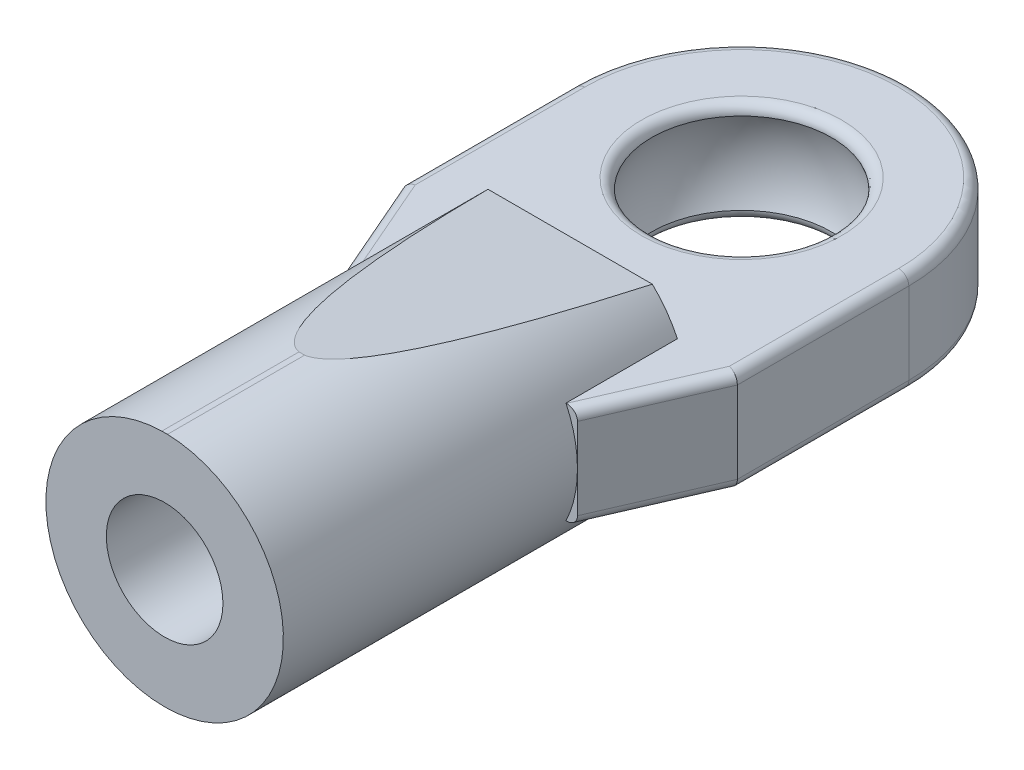
ISO-10303-21;
HEADER;
FILE_DESCRIPTION(('STEP AP214'),'2;1');
FILE_NAME('part.step','',(''),(''),'','','');
FILE_SCHEMA(('AUTOMOTIVE_DESIGN { 1 0 10303 214 1 1 1 1 }'));
ENDSEC;
DATA;
#1=APPLICATION_CONTEXT('core data for automotive mechanical design processes');
#2=APPLICATION_PROTOCOL_DEFINITION('international standard','automotive_design',2000,#1);
#3=PRODUCT_CONTEXT('',#1,'mechanical');
#4=PRODUCT('Part','Part','',(#3));
#5=PRODUCT_RELATED_PRODUCT_CATEGORY('part','',(#4));
#6=PRODUCT_DEFINITION_FORMATION('','',#4);
#7=PRODUCT_DEFINITION_CONTEXT('part definition',#1,'design');
#8=PRODUCT_DEFINITION('design','',#6,#7);
#9=PRODUCT_DEFINITION_SHAPE('','',#8);
#10=(LENGTH_UNIT() NAMED_UNIT(*) SI_UNIT(.MILLI.,.METRE.));
#11=(NAMED_UNIT(*) PLANE_ANGLE_UNIT() SI_UNIT($,.RADIAN.));
#12=(NAMED_UNIT(*) SI_UNIT($,.STERADIAN.) SOLID_ANGLE_UNIT());
#13=UNCERTAINTY_MEASURE_WITH_UNIT(LENGTH_MEASURE(1.E-05),#10,'distance_accuracy_value','');
#14=(GEOMETRIC_REPRESENTATION_CONTEXT(3) GLOBAL_UNCERTAINTY_ASSIGNED_CONTEXT((#13)) GLOBAL_UNIT_ASSIGNED_CONTEXT((#10,
#11,#12)) REPRESENTATION_CONTEXT('',''));
#15=CARTESIAN_POINT('',(0.,0.,0.));
#16=DIRECTION('',(0.,0.,1.));
#17=DIRECTION('',(1.,0.,0.));
#18=AXIS2_PLACEMENT_3D('',#15,#16,#17);
#19=CARTESIAN_POINT('',(0.,0.,5.6642));
#20=DIRECTION('',(0.,0.,-1.));
#21=DIRECTION('',(-1.,0.,0.));
#22=AXIS2_PLACEMENT_3D('',#19,#20,#21);
#23=PLANE('',#22);
#24=DIRECTION('',(1.,0.,0.));
#25=VECTOR('',#24,1.);
#26=CARTESIAN_POINT('',(0.,-1.51,5.6642));
#27=LINE('',#26,#25);
#28=CARTESIAN_POINT('',(-0.838522414727217,-1.51,5.6642));
#29=VERTEX_POINT('',#28);
#30=CARTESIAN_POINT('',(0.838522414727215,-1.51,5.6642));
#31=VERTEX_POINT('',#30);
#32=EDGE_CURVE('E243',#29,#31,#27,.T.);
#33=ORIENTED_EDGE('',*,*,#32,.F.);
#34=CARTESIAN_POINT('',(0.,0.,5.6642));
#35=DIRECTION('',(0.,0.,1.));
#36=DIRECTION('',(1.,0.,0.));
#37=AXIS2_PLACEMENT_3D('',#34,#35,#36);
#38=CIRCLE('',#37,1.72719999999999);
#39=EDGE_CURVE('E263',#29,#31,#38,.T.);
#40=ORIENTED_EDGE('',*,*,#39,.T.);
#41=EDGE_LOOP('',(#33,#40));
#42=FACE_BOUND('',#41,.T.);
#43=ADVANCED_FACE('F55',(#42),#23,.F.);
#44=CARTESIAN_POINT('',(0.,0.,0.));
#45=DIRECTION('',(0.,0.,-1.));
#46=DIRECTION('',(-1.,0.,0.));
#47=AXIS2_PLACEMENT_3D('',#44,#45,#46);
#48=CYLINDRICAL_SURFACE('',#47,3.5179);
#49=CARTESIAN_POINT('',(0.,0.,-15.5618463564135));
#50=DIRECTION('',(0.,-0.992519880266169,0.122083116262772));
#51=DIRECTION('',(0.,-0.122083116262772,-0.992519880266169));
#52=AXIS2_PLACEMENT_3D('',#49,#50,#51);
#53=ELLIPSE('',#52,28.8156143756034,3.5179);
#54=CARTESIAN_POINT('',(2.43496060353404,2.53901305022979,5.08));
#55=VERTEX_POINT('',#54);
#56=CARTESIAN_POINT('',(0.0833247089606735,3.51691305022979,13.0302));
#57=VERTEX_POINT('',#56);
#58=EDGE_CURVE('E385',#55,#57,#53,.T.);
#59=ORIENTED_EDGE('',*,*,#58,.T.);
#60=DIRECTION('',(0.,0.,-1.));
#61=VECTOR('',#60,1.);
#62=CARTESIAN_POINT('',(0.0833247089606735,3.51691305022979,17.0942));
#63=LINE('',#62,#61);
#64=CARTESIAN_POINT('',(0.0833247089606735,3.51691305022979,17.0942));
#65=VERTEX_POINT('',#64);
#66=EDGE_CURVE('E275',#65,#57,#63,.T.);
#67=ORIENTED_EDGE('',*,*,#66,.F.);
#68=CARTESIAN_POINT('',(0.,0.,17.0942));
#69=DIRECTION('',(0.,0.,1.));
#70=DIRECTION('',(-1.,0.,0.));
#71=AXIS2_PLACEMENT_3D('',#68,#69,#70);
#72=CIRCLE('',#71,3.5179);
#73=CARTESIAN_POINT('',(-0.0833247089607028,3.51691305022979,17.0942));
#74=VERTEX_POINT('',#73);
#75=EDGE_CURVE('E267',#74,#65,#72,.T.);
#76=ORIENTED_EDGE('',*,*,#75,.F.);
#77=DIRECTION('',(0.,0.,-1.));
#78=VECTOR('',#77,1.);
#79=CARTESIAN_POINT('',(-0.0833247089607028,3.51691305022979,17.0942));
#80=LINE('',#79,#78);
#81=CARTESIAN_POINT('',(-0.0833247089607028,3.51691305022979,13.0302));
#82=VERTEX_POINT('',#81);
#83=EDGE_CURVE('E272',#74,#82,#80,.T.);
#84=ORIENTED_EDGE('',*,*,#83,.T.);
#85=CARTESIAN_POINT('',(0.,0.,-15.5618463564135));
#86=DIRECTION('',(0.,-0.992519880266169,0.122083116262772));
#87=DIRECTION('',(0.,-0.122083116262772,-0.992519880266169));
#88=AXIS2_PLACEMENT_3D('',#85,#86,#87);
#89=ELLIPSE('',#88,28.8156143756034,3.5179);
#90=CARTESIAN_POINT('',(-2.43496060353404,2.53901305022979,5.08));
#91=VERTEX_POINT('',#90);
#92=EDGE_CURVE('E639',#82,#91,#89,.T.);
#93=ORIENTED_EDGE('',*,*,#92,.T.);
#94=CARTESIAN_POINT('',(0.,0.,5.08));
#95=DIRECTION('',(0.,0.,-1.));
#96=DIRECTION('',(-1.,0.,0.));
#97=AXIS2_PLACEMENT_3D('',#94,#95,#96);
#98=CIRCLE('',#97,3.5179);
#99=CARTESIAN_POINT('',(-3.17734486796759,1.51,5.08));
#100=VERTEX_POINT('',#99);
#101=EDGE_CURVE('E278',#91,#100,#98,.F.);
#102=ORIENTED_EDGE('',*,*,#101,.T.);
#103=DIRECTION('',(0.,0.,-1.));
#104=VECTOR('',#103,1.);
#105=CARTESIAN_POINT('',(-3.17734486796759,1.51,0.));
#106=LINE('',#105,#104);
#107=CARTESIAN_POINT('',(-3.17734486796759,1.51,8.382));
#108=VERTEX_POINT('',#107);
#109=EDGE_CURVE('E366',#100,#108,#106,.F.);
#110=ORIENTED_EDGE('',*,*,#109,.T.);
#111=CARTESIAN_POINT('',(0.,0.,8.382));
#112=DIRECTION('',(0.,0.,-1.));
#113=DIRECTION('',(-1.,0.,0.));
#114=AXIS2_PLACEMENT_3D('',#111,#112,#113);
#115=CIRCLE('',#114,3.5179);
#116=CARTESIAN_POINT('',(-3.51789999999999,0.,8.382));
#117=VERTEX_POINT('',#116);
#118=EDGE_CURVE('E477',#108,#117,#115,.F.);
#119=ORIENTED_EDGE('',*,*,#118,.T.);
#120=CARTESIAN_POINT('',(0.,0.,8.382));
#121=DIRECTION('',(0.,0.,-1.));
#122=DIRECTION('',(-1.,0.,0.));
#123=AXIS2_PLACEMENT_3D('',#120,#121,#122);
#124=CIRCLE('',#123,3.5179);
#125=CARTESIAN_POINT('',(-3.17734486796759,-1.51,8.382));
#126=VERTEX_POINT('',#125);
#127=EDGE_CURVE('E283',#117,#126,#124,.F.);
#128=ORIENTED_EDGE('',*,*,#127,.T.);
#129=DIRECTION('',(0.,0.,-1.));
#130=VECTOR('',#129,1.);
#131=CARTESIAN_POINT('',(-3.17734486796759,-1.51,0.));
#132=LINE('',#131,#130);
#133=CARTESIAN_POINT('',(-3.17734486796759,-1.51,5.08));
#134=VERTEX_POINT('',#133);
#135=EDGE_CURVE('E450',#126,#134,#132,.T.);
#136=ORIENTED_EDGE('',*,*,#135,.T.);
#137=CARTESIAN_POINT('',(0.,0.,5.07999999999999));
#138=DIRECTION('',(0.,0.,-1.));
#139=DIRECTION('',(0.,1.,0.));
#140=AXIS2_PLACEMENT_3D('',#137,#138,#139);
#141=CIRCLE('',#140,3.5179);
#142=CARTESIAN_POINT('',(-2.43290068253873,-2.54098694977022,5.08));
#143=VERTEX_POINT('',#142);
#144=EDGE_CURVE('E482',#134,#143,#141,.F.);
#145=ORIENTED_EDGE('',*,*,#144,.T.);
#146=CARTESIAN_POINT('',(0.,0.,-15.577893903327));
#147=DIRECTION('',(0.,0.992519880266169,0.12208311626277));
#148=DIRECTION('',(0.,0.12208311626277,-0.992519880266169));
#149=AXIS2_PLACEMENT_3D('',#146,#147,#148);
#150=ELLIPSE('',#149,28.8156143756039,3.5179);
#151=CARTESIAN_POINT('',(2.43290068253873,-2.54098694977022,5.08));
#152=VERTEX_POINT('',#151);
#153=EDGE_CURVE('E454',#143,#152,#150,.T.);
#154=ORIENTED_EDGE('',*,*,#153,.T.);
#155=CARTESIAN_POINT('',(0.,0.,5.07999999999999));
#156=DIRECTION('',(0.,0.,-1.));
#157=DIRECTION('',(0.,1.,0.));
#158=AXIS2_PLACEMENT_3D('',#155,#156,#157);
#159=CIRCLE('',#158,3.5179);
#160=CARTESIAN_POINT('',(3.17734486796759,-1.51,5.08));
#161=VERTEX_POINT('',#160);
#162=EDGE_CURVE('E480',#152,#161,#159,.F.);
#163=ORIENTED_EDGE('',*,*,#162,.T.);
#164=DIRECTION('',(0.,0.,-1.));
#165=VECTOR('',#164,1.);
#166=CARTESIAN_POINT('',(3.17734486796759,-1.51,0.));
#167=LINE('',#166,#165);
#168=CARTESIAN_POINT('',(3.17734486796759,-1.51,8.382));
#169=VERTEX_POINT('',#168);
#170=EDGE_CURVE('E285',#161,#169,#167,.F.);
#171=ORIENTED_EDGE('',*,*,#170,.T.);
#172=CARTESIAN_POINT('',(0.,0.,8.382));
#173=DIRECTION('',(0.,0.,-1.));
#174=DIRECTION('',(-1.,0.,0.));
#175=AXIS2_PLACEMENT_3D('',#172,#173,#174);
#176=CIRCLE('',#175,3.5179);
#177=CARTESIAN_POINT('',(3.5179,0.,8.382));
#178=VERTEX_POINT('',#177);
#179=EDGE_CURVE('E244',#169,#178,#176,.F.);
#180=ORIENTED_EDGE('',*,*,#179,.T.);
#181=CARTESIAN_POINT('',(0.,0.,8.38200000000001));
#182=DIRECTION('',(0.,0.,-1.));
#183=DIRECTION('',(-1.,0.,0.));
#184=AXIS2_PLACEMENT_3D('',#181,#182,#183);
#185=CIRCLE('',#184,3.5179);
#186=CARTESIAN_POINT('',(3.17734486796759,1.51,8.382));
#187=VERTEX_POINT('',#186);
#188=EDGE_CURVE('E386',#178,#187,#185,.F.);
#189=ORIENTED_EDGE('',*,*,#188,.T.);
#190=DIRECTION('',(0.,0.,-1.));
#191=VECTOR('',#190,1.);
#192=CARTESIAN_POINT('',(3.17734486796759,1.51,0.));
#193=LINE('',#192,#191);
#194=CARTESIAN_POINT('',(3.17734486796759,1.51,5.08));
#195=VERTEX_POINT('',#194);
#196=EDGE_CURVE('E380',#187,#195,#193,.T.);
#197=ORIENTED_EDGE('',*,*,#196,.T.);
#198=CARTESIAN_POINT('',(0.,0.,5.08));
#199=DIRECTION('',(0.,0.,-1.));
#200=DIRECTION('',(-1.,0.,0.));
#201=AXIS2_PLACEMENT_3D('',#198,#199,#200);
#202=CIRCLE('',#201,3.5179);
#203=EDGE_CURVE('E630',#195,#55,#202,.F.);
#204=ORIENTED_EDGE('',*,*,#203,.T.);
#205=EDGE_LOOP('',(#59,#67,#76,#84,#93,#102,#110,#119,#128,#136,#145,#154,#163,#171,#180,#189,
#197,#204));
#206=FACE_BOUND('',#205,.T.);
#207=ADVANCED_FACE('F619',(#206),#48,.T.);
#208=CARTESIAN_POINT('',(0.,0.,5.08));
#209=DIRECTION('',(0.,0.,1.));
#210=DIRECTION('',(1.,0.,0.));
#211=AXIS2_PLACEMENT_3D('',#208,#209,#210);
#212=PLANE('',#211);
#213=DIRECTION('',(1.,0.,0.));
#214=VECTOR('',#213,1.);
#215=CARTESIAN_POINT('',(0.,1.51,5.08));
#216=LINE('',#215,#214);
#217=EDGE_CURVE('E359',#100,#195,#216,.T.);
#218=ORIENTED_EDGE('',*,*,#217,.F.);
#219=ORIENTED_EDGE('',*,*,#101,.F.);
#220=DIRECTION('',(1.,0.,0.));
#221=VECTOR('',#220,1.);
#222=CARTESIAN_POINT('',(-6.17972211068289,2.53901305022979,5.08));
#223=LINE('',#222,#221);
#224=EDGE_CURVE('E368',#91,#55,#223,.T.);
#225=ORIENTED_EDGE('',*,*,#224,.T.);
#226=ORIENTED_EDGE('',*,*,#203,.F.);
#227=EDGE_LOOP('',(#218,#219,#225,#226));
#228=FACE_BOUND('',#227,.T.);
#229=ADVANCED_FACE('F640',(#228),#212,.F.);
#230=CARTESIAN_POINT('',(3.5179,1.51,8.382));
#231=DIRECTION('',(-0.917126126803996,0.,-0.398597124341735));
#232=DIRECTION('',(-0.398597124341735,0.,0.917126126803996));
#233=AXIS2_PLACEMENT_3D('',#230,#231,#232);
#234=PLANE('',#233);
#235=DIRECTION('',(0.,1.,0.));
#236=VECTOR('',#235,1.);
#237=CARTESIAN_POINT('',(3.5179,1.51,8.382));
#238=LINE('',#237,#236);
#239=CARTESIAN_POINT('',(3.5179,-1.21,8.382));
#240=VERTEX_POINT('',#239);
#241=EDGE_CURVE('E324',#240,#178,#238,.T.);
#242=ORIENTED_EDGE('',*,*,#241,.F.);
#243=DIRECTION('',(0.398597124341735,0.,-0.917126126803996));
#244=VECTOR('',#243,1.);
#245=CARTESIAN_POINT('',(3.5179,-1.21,8.382));
#246=LINE('',#245,#244);
#247=CARTESIAN_POINT('',(4.953,-1.21,5.08));
#248=VERTEX_POINT('',#247);
#249=EDGE_CURVE('E533',#240,#248,#246,.T.);
#250=ORIENTED_EDGE('',*,*,#249,.T.);
#251=DIRECTION('',(0.,1.,0.));
#252=VECTOR('',#251,1.);
#253=CARTESIAN_POINT('',(4.953,1.51,5.08));
#254=LINE('',#253,#252);
#255=CARTESIAN_POINT('',(4.953,1.21,5.08));
#256=VERTEX_POINT('',#255);
#257=EDGE_CURVE('E317',#248,#256,#254,.T.);
#258=ORIENTED_EDGE('',*,*,#257,.T.);
#259=DIRECTION('',(0.398597124341735,0.,-0.917126126803996));
#260=VECTOR('',#259,1.);
#261=CARTESIAN_POINT('',(3.5179,1.21,8.382));
#262=LINE('',#261,#260);
#263=CARTESIAN_POINT('',(3.5179,1.21,8.382));
#264=VERTEX_POINT('',#263);
#265=EDGE_CURVE('E531',#256,#264,#262,.F.);
#266=ORIENTED_EDGE('',*,*,#265,.T.);
#267=DIRECTION('',(0.,1.,0.));
#268=VECTOR('',#267,1.);
#269=CARTESIAN_POINT('',(3.5179,1.51,8.382));
#270=LINE('',#269,#268);
#271=EDGE_CURVE('E344',#264,#178,#270,.F.);
#272=ORIENTED_EDGE('',*,*,#271,.T.);
#273=EDGE_LOOP('',(#242,#250,#258,#266,#272));
#274=FACE_BOUND('',#273,.T.);
#275=ADVANCED_FACE('F582',(#274),#234,.F.);
#276=CARTESIAN_POINT('',(4.95299999999997,1.51,0.));
#277=DIRECTION('',(-1.,0.,0.));
#278=DIRECTION('',(0.,0.,1.));
#279=AXIS2_PLACEMENT_3D('',#276,#277,#278);
#280=PLANE('',#279);
#281=ORIENTED_EDGE('',*,*,#257,.F.);
#282=DIRECTION('',(0.,0.,-1.));
#283=VECTOR('',#282,1.);
#284=CARTESIAN_POINT('',(4.95299999999997,-1.21,0.));
#285=LINE('',#284,#283);
#286=CARTESIAN_POINT('',(4.95299999999998,-1.21,0.));
#287=VERTEX_POINT('',#286);
#288=EDGE_CURVE('E518',#248,#287,#285,.T.);
#289=ORIENTED_EDGE('',*,*,#288,.T.);
#290=DIRECTION('',(0.,-1.,0.));
#291=VECTOR('',#290,1.);
#292=CARTESIAN_POINT('',(4.95299999999998,1.51,0.));
#293=LINE('',#292,#291);
#294=CARTESIAN_POINT('',(4.95299999999998,1.21,0.));
#295=VERTEX_POINT('',#294);
#296=EDGE_CURVE('E323',#295,#287,#293,.T.);
#297=ORIENTED_EDGE('',*,*,#296,.F.);
#298=DIRECTION('',(0.,0.,-1.));
#299=VECTOR('',#298,1.);
#300=CARTESIAN_POINT('',(4.953,1.21,5.08));
#301=LINE('',#300,#299);
#302=EDGE_CURVE('E512',#295,#256,#301,.F.);
#303=ORIENTED_EDGE('',*,*,#302,.T.);
#304=EDGE_LOOP('',(#281,#289,#297,#303));
#305=FACE_BOUND('',#304,.T.);
#306=ADVANCED_FACE('F833',(#305),#280,.F.);
#307=CARTESIAN_POINT('',(0.,1.51,0.));
#308=DIRECTION('',(0.,-1.,0.));
#309=DIRECTION('',(0.,0.,-1.));
#310=AXIS2_PLACEMENT_3D('',#307,#308,#309);
#311=CYLINDRICAL_SURFACE('',#310,4.95299999999998);
#312=ORIENTED_EDGE('',*,*,#296,.T.);
#313=CARTESIAN_POINT('',(0.,-1.21,0.));
#314=DIRECTION('',(0.,1.,0.));
#315=DIRECTION('',(0.,0.,1.));
#316=AXIS2_PLACEMENT_3D('',#313,#314,#315);
#317=CIRCLE('',#316,4.95299999999998);
#318=CARTESIAN_POINT('',(-4.95299999999999,-1.21,0.));
#319=VERTEX_POINT('',#318);
#320=EDGE_CURVE('E529',#287,#319,#317,.T.);
#321=ORIENTED_EDGE('',*,*,#320,.T.);
#322=DIRECTION('',(0.,1.,0.));
#323=VECTOR('',#322,1.);
#324=CARTESIAN_POINT('',(-4.95299999999999,1.51,0.));
#325=LINE('',#324,#323);
#326=CARTESIAN_POINT('',(-4.95299999999999,1.21,0.));
#327=VERTEX_POINT('',#326);
#328=EDGE_CURVE('E516',#319,#327,#325,.T.);
#329=ORIENTED_EDGE('',*,*,#328,.T.);
#330=CARTESIAN_POINT('',(0.,1.21,0.));
#331=DIRECTION('',(0.,1.,0.));
#332=DIRECTION('',(0.,0.,1.));
#333=AXIS2_PLACEMENT_3D('',#330,#331,#332);
#334=CIRCLE('',#333,4.95299999999998);
#335=EDGE_CURVE('E527',#327,#295,#334,.F.);
#336=ORIENTED_EDGE('',*,*,#335,.T.);
#337=EDGE_LOOP('',(#312,#321,#329,#336));
#338=FACE_BOUND('',#337,.T.);
#339=ADVANCED_FACE('F845',(#338),#311,.T.);
#340=CARTESIAN_POINT('',(-4.95299999999999,1.51,0.));
#341=DIRECTION('',(1.,0.,0.));
#342=DIRECTION('',(0.,0.,-1.));
#343=AXIS2_PLACEMENT_3D('',#340,#341,#342);
#344=PLANE('',#343);
#345=ORIENTED_EDGE('',*,*,#328,.F.);
#346=DIRECTION('',(0.,0.,-1.));
#347=VECTOR('',#346,1.);
#348=CARTESIAN_POINT('',(-4.95299999999999,-1.21,0.));
#349=LINE('',#348,#347);
#350=CARTESIAN_POINT('',(-4.95299999999999,-1.21,5.08));
#351=VERTEX_POINT('',#350);
#352=EDGE_CURVE('E525',#319,#351,#349,.F.);
#353=ORIENTED_EDGE('',*,*,#352,.T.);
#354=DIRECTION('',(0.,1.,0.));
#355=VECTOR('',#354,1.);
#356=CARTESIAN_POINT('',(-4.95299999999999,1.51,5.08));
#357=LINE('',#356,#355);
#358=CARTESIAN_POINT('',(-4.95299999999999,1.21,5.08));
#359=VERTEX_POINT('',#358);
#360=EDGE_CURVE('E339',#351,#359,#357,.T.);
#361=ORIENTED_EDGE('',*,*,#360,.T.);
#362=DIRECTION('',(0.,0.,-1.));
#363=VECTOR('',#362,1.);
#364=CARTESIAN_POINT('',(-4.95299999999999,1.21,0.));
#365=LINE('',#364,#363);
#366=EDGE_CURVE('E520',#359,#327,#365,.T.);
#367=ORIENTED_EDGE('',*,*,#366,.T.);
#368=EDGE_LOOP('',(#345,#353,#361,#367));
#369=FACE_BOUND('',#368,.T.);
#370=ADVANCED_FACE('F858',(#369),#344,.F.);
#371=CARTESIAN_POINT('',(-3.51789999999999,1.51,8.382));
#372=DIRECTION('',(0.917126126803995,0.,-0.398597124341737));
#373=DIRECTION('',(-0.398597124341737,0.,-0.917126126803995));
#374=AXIS2_PLACEMENT_3D('',#371,#372,#373);
#375=PLANE('',#374);
#376=ORIENTED_EDGE('',*,*,#360,.F.);
#377=DIRECTION('',(-0.398597124341737,0.,-0.917126126803995));
#378=VECTOR('',#377,1.);
#379=CARTESIAN_POINT('',(-3.51789999999999,-1.21,8.382));
#380=LINE('',#379,#378);
#381=CARTESIAN_POINT('',(-3.51789999999999,-1.21,8.382));
#382=VERTEX_POINT('',#381);
#383=EDGE_CURVE('E508',#351,#382,#380,.F.);
#384=ORIENTED_EDGE('',*,*,#383,.T.);
#385=DIRECTION('',(0.,1.,0.));
#386=VECTOR('',#385,1.);
#387=CARTESIAN_POINT('',(-3.51789999999999,1.51,8.382));
#388=LINE('',#387,#386);
#389=EDGE_CURVE('E345',#117,#382,#388,.F.);
#390=ORIENTED_EDGE('',*,*,#389,.F.);
#391=DIRECTION('',(0.,1.,0.));
#392=VECTOR('',#391,1.);
#393=CARTESIAN_POINT('',(-3.51789999999999,1.51,8.382));
#394=LINE('',#393,#392);
#395=CARTESIAN_POINT('',(-3.51789999999999,1.21,8.382));
#396=VERTEX_POINT('',#395);
#397=EDGE_CURVE('E364',#117,#396,#394,.T.);
#398=ORIENTED_EDGE('',*,*,#397,.T.);
#399=DIRECTION('',(-0.398597124341737,0.,-0.917126126803995));
#400=VECTOR('',#399,1.);
#401=CARTESIAN_POINT('',(-4.95299999999999,1.21,5.08));
#402=LINE('',#401,#400);
#403=EDGE_CURVE('E505',#396,#359,#402,.T.);
#404=ORIENTED_EDGE('',*,*,#403,.T.);
#405=EDGE_LOOP('',(#376,#384,#390,#398,#404));
#406=FACE_BOUND('',#405,.T.);
#407=ADVANCED_FACE('F871',(#406),#375,.F.);
#408=CARTESIAN_POINT('',(-3.51789999999999,1.51,8.382));
#409=DIRECTION('',(0.,0.,-1.));
#410=DIRECTION('',(-1.,0.,0.));
#411=AXIS2_PLACEMENT_3D('',#408,#409,#410);
#412=PLANE('',#411);
#413=ORIENTED_EDGE('',*,*,#271,.F.);
#414=CARTESIAN_POINT('',(3.19079122920809,1.21,8.382));
#415=DIRECTION('',(0.,0.,-1.));
#416=DIRECTION('',(-1.,0.,0.));
#417=AXIS2_PLACEMENT_3D('',#414,#415,#416);
#418=ELLIPSE('',#417,0.32710877079191,0.3);
#419=CARTESIAN_POINT('',(3.19079122920809,1.51,8.382));
#420=VERTEX_POINT('',#419);
#421=EDGE_CURVE('E13',#264,#420,#418,.F.);
#422=ORIENTED_EDGE('',*,*,#421,.T.);
#423=DIRECTION('',(1.,0.,0.));
#424=VECTOR('',#423,1.);
#425=CARTESIAN_POINT('',(0.,1.51,8.382));
#426=LINE('',#425,#424);
#427=EDGE_CURVE('E365',#187,#420,#426,.T.);
#428=ORIENTED_EDGE('',*,*,#427,.F.);
#429=ORIENTED_EDGE('',*,*,#188,.F.);
#430=EDGE_LOOP('',(#413,#422,#428,#429));
#431=FACE_BOUND('',#430,.T.);
#432=ADVANCED_FACE('F586',(#431),#412,.F.);
#433=CARTESIAN_POINT('',(-6.17972211068289,3.51691305022979,13.0302));
#434=DIRECTION('',(0.,-0.992519880266169,0.122083116262772));
#435=DIRECTION('',(0.,-0.122083116262772,-0.992519880266169));
#436=AXIS2_PLACEMENT_3D('',#433,#434,#435);
#437=PLANE('',#436);
#438=ORIENTED_EDGE('',*,*,#92,.F.);
#439=DIRECTION('',(1.,0.,0.));
#440=VECTOR('',#439,1.);
#441=CARTESIAN_POINT('',(-6.17972211068289,3.51691305022979,13.0302));
#442=LINE('',#441,#440);
#443=EDGE_CURVE('E591',#57,#82,#442,.F.);
#444=ORIENTED_EDGE('',*,*,#443,.F.);
#445=ORIENTED_EDGE('',*,*,#58,.F.);
#446=ORIENTED_EDGE('',*,*,#224,.F.);
#447=EDGE_LOOP('',(#438,#444,#445,#446));
#448=FACE_BOUND('',#447,.T.);
#449=ADVANCED_FACE('F895',(#448),#437,.F.);
#450=CARTESIAN_POINT('',(0.,1.51,0.));
#451=DIRECTION('',(0.,1.,0.));
#452=DIRECTION('',(0.,0.,1.));
#453=AXIS2_PLACEMENT_3D('',#450,#451,#452);
#454=PLANE('',#453);
#455=CARTESIAN_POINT('',(0.,1.51,0.));
#456=DIRECTION('',(0.,1.,0.));
#457=DIRECTION('',(0.,0.,1.));
#458=AXIS2_PLACEMENT_3D('',#455,#456,#457);
#459=CIRCLE('',#458,2.967);
#460=CARTESIAN_POINT('',(0.,1.51,2.967));
#461=VERTEX_POINT('',#460);
#462=EDGE_CURVE('E537',#461,#461,#459,.F.);
#463=ORIENTED_EDGE('',*,*,#462,.T.);
#464=EDGE_LOOP('',(#463));
#465=FACE_BOUND('',#464,.T.);
#466=DIRECTION('',(0.,0.,-1.));
#467=VECTOR('',#466,1.);
#468=CARTESIAN_POINT('',(-4.65299999999999,1.51,5.08));
#469=LINE('',#468,#467);
#470=CARTESIAN_POINT('',(-4.65299999999998,1.51,0.));
#471=VERTEX_POINT('',#470);
#472=CARTESIAN_POINT('',(-4.65299999999999,1.51,5.01762583711596));
#473=VERTEX_POINT('',#472);
#474=EDGE_CURVE('E72',#471,#473,#469,.F.);
#475=ORIENTED_EDGE('',*,*,#474,.T.);
#476=DIRECTION('',(-0.398597124341737,0.,-0.917126126803995));
#477=VECTOR('',#476,1.);
#478=CARTESIAN_POINT('',(-3.24276216195879,1.51,8.26242086269748));
#479=LINE('',#478,#477);
#480=CARTESIAN_POINT('',(-3.19079122920808,1.51,8.382));
#481=VERTEX_POINT('',#480);
#482=EDGE_CURVE('E547',#473,#481,#479,.F.);
#483=ORIENTED_EDGE('',*,*,#482,.T.);
#484=DIRECTION('',(-1.,0.,0.));
#485=VECTOR('',#484,1.);
#486=CARTESIAN_POINT('',(-3.51789999999999,1.51,8.382));
#487=LINE('',#486,#485);
#488=EDGE_CURVE('E425',#481,#108,#487,.F.);
#489=ORIENTED_EDGE('',*,*,#488,.T.);
#490=ORIENTED_EDGE('',*,*,#109,.F.);
#491=ORIENTED_EDGE('',*,*,#217,.T.);
#492=ORIENTED_EDGE('',*,*,#196,.F.);
#493=ORIENTED_EDGE('',*,*,#427,.T.);
#494=DIRECTION('',(0.398597124341735,0.,-0.917126126803996));
#495=VECTOR('',#494,1.);
#496=CARTESIAN_POINT('',(4.6778621619588,1.51,4.96042086269748));
#497=LINE('',#496,#495);
#498=CARTESIAN_POINT('',(4.653,1.51,5.01762583711596));
#499=VERTEX_POINT('',#498);
#500=EDGE_CURVE('E541',#420,#499,#497,.T.);
#501=ORIENTED_EDGE('',*,*,#500,.T.);
#502=DIRECTION('',(0.,0.,-1.));
#503=VECTOR('',#502,1.);
#504=CARTESIAN_POINT('',(4.65299999999997,1.51,0.));
#505=LINE('',#504,#503);
#506=CARTESIAN_POINT('',(4.65299999999997,1.51,0.));
#507=VERTEX_POINT('',#506);
#508=EDGE_CURVE('E543',#499,#507,#505,.T.);
#509=ORIENTED_EDGE('',*,*,#508,.T.);
#510=CARTESIAN_POINT('',(0.,1.51,0.));
#511=DIRECTION('',(0.,1.,0.));
#512=DIRECTION('',(0.,0.,1.));
#513=AXIS2_PLACEMENT_3D('',#510,#511,#512);
#514=CIRCLE('',#513,4.65299999999998);
#515=EDGE_CURVE('E77',#507,#471,#514,.T.);
#516=ORIENTED_EDGE('',*,*,#515,.T.);
#517=EDGE_LOOP('',(#475,#483,#489,#490,#491,#492,#493,#501,#509,#516));
#518=FACE_BOUND('',#517,.T.);
#519=ADVANCED_FACE('F614',(#465,#518),#454,.T.);
#520=CARTESIAN_POINT('',(-3.51789999999999,1.51,8.382));
#521=DIRECTION('',(0.,0.,-1.));
#522=DIRECTION('',(-1.,0.,0.));
#523=AXIS2_PLACEMENT_3D('',#520,#521,#522);
#524=PLANE('',#523);
#525=ORIENTED_EDGE('',*,*,#488,.F.);
#526=CARTESIAN_POINT('',(-3.19079122920808,1.21,8.382));
#527=DIRECTION('',(0.,0.,-1.));
#528=DIRECTION('',(1.,0.,0.));
#529=AXIS2_PLACEMENT_3D('',#526,#527,#528);
#530=ELLIPSE('',#529,0.32710877079191,0.3);
#531=EDGE_CURVE('E64',#481,#396,#530,.F.);
#532=ORIENTED_EDGE('',*,*,#531,.T.);
#533=ORIENTED_EDGE('',*,*,#397,.F.);
#534=ORIENTED_EDGE('',*,*,#118,.F.);
#535=EDGE_LOOP('',(#525,#532,#533,#534));
#536=FACE_BOUND('',#535,.T.);
#537=ADVANCED_FACE('F919',(#536),#524,.F.);
#538=CARTESIAN_POINT('',(-6.17972211068289,-2.54098694977022,5.08));
#539=DIRECTION('',(0.,0.,-1.));
#540=DIRECTION('',(0.,1.,0.));
#541=AXIS2_PLACEMENT_3D('',#538,#539,#540);
#542=PLANE('',#541);
#543=ORIENTED_EDGE('',*,*,#162,.F.);
#544=DIRECTION('',(1.,0.,0.));
#545=VECTOR('',#544,1.);
#546=CARTESIAN_POINT('',(-6.17972211068289,-2.54098694977022,5.08));
#547=LINE('',#546,#545);
#548=EDGE_CURVE('E455',#152,#143,#547,.F.);
#549=ORIENTED_EDGE('',*,*,#548,.T.);
#550=ORIENTED_EDGE('',*,*,#144,.F.);
#551=DIRECTION('',(-1.,0.,0.));
#552=VECTOR('',#551,1.);
#553=CARTESIAN_POINT('',(0.,-1.51,5.08));
#554=LINE('',#553,#552);
#555=EDGE_CURVE('E459',#134,#161,#554,.F.);
#556=ORIENTED_EDGE('',*,*,#555,.T.);
#557=EDGE_LOOP('',(#543,#549,#550,#556));
#558=FACE_BOUND('',#557,.T.);
#559=ADVANCED_FACE('F932',(#558),#542,.T.);
#560=CARTESIAN_POINT('',(-3.51789999999999,1.51,8.382));
#561=DIRECTION('',(0.,0.,-1.));
#562=DIRECTION('',(-1.,0.,0.));
#563=AXIS2_PLACEMENT_3D('',#560,#561,#562);
#564=PLANE('',#563);
#565=ORIENTED_EDGE('',*,*,#389,.T.);
#566=CARTESIAN_POINT('',(-3.19079122920808,-1.21,8.382));
#567=DIRECTION('',(0.,0.,-1.));
#568=DIRECTION('',(-1.,0.,0.));
#569=AXIS2_PLACEMENT_3D('',#566,#567,#568);
#570=ELLIPSE('',#569,0.32710877079191,0.3);
#571=CARTESIAN_POINT('',(-3.19079122920808,-1.51,8.382));
#572=VERTEX_POINT('',#571);
#573=EDGE_CURVE('E510',#382,#572,#570,.F.);
#574=ORIENTED_EDGE('',*,*,#573,.T.);
#575=DIRECTION('',(1.,0.,0.));
#576=VECTOR('',#575,1.);
#577=CARTESIAN_POINT('',(0.,-1.51,8.382));
#578=LINE('',#577,#576);
#579=EDGE_CURVE('E284',#572,#126,#578,.T.);
#580=ORIENTED_EDGE('',*,*,#579,.T.);
#581=ORIENTED_EDGE('',*,*,#127,.F.);
#582=EDGE_LOOP('',(#565,#574,#580,#581));
#583=FACE_BOUND('',#582,.T.);
#584=ADVANCED_FACE('F675',(#583),#564,.F.);
#585=CARTESIAN_POINT('',(-6.17972211068289,-2.54098694977022,5.07999999999999));
#586=DIRECTION('',(0.,0.992519880266169,0.12208311626277));
#587=DIRECTION('',(0.,-0.12208311626277,0.992519880266169));
#588=AXIS2_PLACEMENT_3D('',#585,#586,#587);
#589=PLANE('',#588);
#590=ORIENTED_EDGE('',*,*,#153,.F.);
#591=ORIENTED_EDGE('',*,*,#548,.F.);
#592=EDGE_LOOP('',(#590,#591));
#593=FACE_BOUND('',#592,.T.);
#594=ADVANCED_FACE('F957',(#593),#589,.F.);
#595=CARTESIAN_POINT('',(0.,-1.51,0.));
#596=DIRECTION('',(0.,1.,0.));
#597=DIRECTION('',(0.,0.,1.));
#598=AXIS2_PLACEMENT_3D('',#595,#596,#597);
#599=PLANE('',#598);
#600=CARTESIAN_POINT('',(0.,-1.51,0.));
#601=DIRECTION('',(0.,1.,0.));
#602=DIRECTION('',(0.,0.,1.));
#603=AXIS2_PLACEMENT_3D('',#600,#601,#602);
#604=CIRCLE('',#603,2.967);
#605=CARTESIAN_POINT('',(0.,-1.51,2.967));
#606=VERTEX_POINT('',#605);
#607=EDGE_CURVE('E491',#606,#606,#604,.T.);
#608=ORIENTED_EDGE('',*,*,#607,.T.);
#609=EDGE_LOOP('',(#608));
#610=FACE_BOUND('',#609,.T.);
#611=ORIENTED_EDGE('',*,*,#579,.F.);
#612=DIRECTION('',(-0.398597124341737,0.,-0.917126126803995));
#613=VECTOR('',#612,1.);
#614=CARTESIAN_POINT('',(-5.74799545962332,-1.51,2.49816725745168));
#615=LINE('',#614,#613);
#616=CARTESIAN_POINT('',(-4.65299999999999,-1.51,5.01762583711596));
#617=VERTEX_POINT('',#616);
#618=EDGE_CURVE('E502',#572,#617,#615,.T.);
#619=ORIENTED_EDGE('',*,*,#618,.T.);
#620=DIRECTION('',(0.,0.,-1.));
#621=VECTOR('',#620,1.);
#622=CARTESIAN_POINT('',(-4.65299999999999,-1.51,0.));
#623=LINE('',#622,#621);
#624=CARTESIAN_POINT('',(-4.65299999999998,-1.51,0.));
#625=VERTEX_POINT('',#624);
#626=EDGE_CURVE('E500',#617,#625,#623,.T.);
#627=ORIENTED_EDGE('',*,*,#626,.T.);
#628=CARTESIAN_POINT('',(0.,-1.51,0.));
#629=DIRECTION('',(0.,1.,0.));
#630=DIRECTION('',(0.,0.,1.));
#631=AXIS2_PLACEMENT_3D('',#628,#629,#630);
#632=CIRCLE('',#631,4.65299999999998);
#633=CARTESIAN_POINT('',(4.65299999999997,-1.51,0.));
#634=VERTEX_POINT('',#633);
#635=EDGE_CURVE('E498',#625,#634,#632,.F.);
#636=ORIENTED_EDGE('',*,*,#635,.T.);
#637=DIRECTION('',(0.,0.,-1.));
#638=VECTOR('',#637,1.);
#639=CARTESIAN_POINT('',(4.65299999999997,-1.51,0.));
#640=LINE('',#639,#638);
#641=CARTESIAN_POINT('',(4.653,-1.51,5.01762583711596));
#642=VERTEX_POINT('',#641);
#643=EDGE_CURVE('E496',#634,#642,#640,.F.);
#644=ORIENTED_EDGE('',*,*,#643,.T.);
#645=DIRECTION('',(0.398597124341735,0.,-0.917126126803996));
#646=VECTOR('',#645,1.);
#647=CARTESIAN_POINT('',(5.74799545962332,-1.51,2.49816725745166));
#648=LINE('',#647,#646);
#649=CARTESIAN_POINT('',(3.1907912292081,-1.51,8.382));
#650=VERTEX_POINT('',#649);
#651=EDGE_CURVE('E494',#642,#650,#648,.F.);
#652=ORIENTED_EDGE('',*,*,#651,.T.);
#653=DIRECTION('',(-1.,0.,0.));
#654=VECTOR('',#653,1.);
#655=CARTESIAN_POINT('',(-3.51789999999999,-1.51,8.382));
#656=LINE('',#655,#654);
#657=EDGE_CURVE('E279',#650,#169,#656,.T.);
#658=ORIENTED_EDGE('',*,*,#657,.T.);
#659=ORIENTED_EDGE('',*,*,#170,.F.);
#660=ORIENTED_EDGE('',*,*,#555,.F.);
#661=ORIENTED_EDGE('',*,*,#135,.F.);
#662=EDGE_LOOP('',(#611,#619,#627,#636,#644,#652,#658,#659,#660,#661));
#663=FACE_BOUND('',#662,.T.);
#664=ADVANCED_FACE('F686',(#610,#663),#599,.F.);
#665=CARTESIAN_POINT('',(-3.51789999999999,1.51,8.382));
#666=DIRECTION('',(0.,0.,-1.));
#667=DIRECTION('',(-1.,0.,0.));
#668=AXIS2_PLACEMENT_3D('',#665,#666,#667);
#669=PLANE('',#668);
#670=ORIENTED_EDGE('',*,*,#657,.F.);
#671=CARTESIAN_POINT('',(3.1907912292081,-1.21,8.382));
#672=DIRECTION('',(0.,0.,-1.));
#673=DIRECTION('',(1.,0.,0.));
#674=AXIS2_PLACEMENT_3D('',#671,#672,#673);
#675=ELLIPSE('',#674,0.32710877079191,0.3);
#676=EDGE_CURVE('E535',#650,#240,#675,.F.);
#677=ORIENTED_EDGE('',*,*,#676,.T.);
#678=ORIENTED_EDGE('',*,*,#241,.T.);
#679=ORIENTED_EDGE('',*,*,#179,.F.);
#680=EDGE_LOOP('',(#670,#677,#678,#679));
#681=FACE_BOUND('',#680,.T.);
#682=ADVANCED_FACE('F701',(#681),#669,.F.);
#683=CARTESIAN_POINT('',(-0.0833247089607028,3.51691305022979,17.0942));
#684=DIRECTION('',(0.,-1.,0.));
#685=DIRECTION('',(0.,0.,-1.));
#686=AXIS2_PLACEMENT_3D('',#683,#684,#685);
#687=PLANE('',#686);
#688=ORIENTED_EDGE('',*,*,#443,.T.);
#689=ORIENTED_EDGE('',*,*,#83,.F.);
#690=DIRECTION('',(-1.,0.,0.));
#691=VECTOR('',#690,1.);
#692=CARTESIAN_POINT('',(-0.0833247089607028,3.51691305022979,17.0942));
#693=LINE('',#692,#691);
#694=EDGE_CURVE('E270',#65,#74,#693,.T.);
#695=ORIENTED_EDGE('',*,*,#694,.F.);
#696=ORIENTED_EDGE('',*,*,#66,.T.);
#697=EDGE_LOOP('',(#688,#689,#695,#696));
#698=FACE_BOUND('',#697,.T.);
#699=ADVANCED_FACE('F821',(#698),#687,.F.);
#700=CARTESIAN_POINT('',(0.,0.,17.0942));
#701=DIRECTION('',(0.,0.,-1.));
#702=DIRECTION('',(-1.,0.,0.));
#703=AXIS2_PLACEMENT_3D('',#700,#701,#702);
#704=PLANE('',#703);
#705=CARTESIAN_POINT('',(0.,0.,17.0942));
#706=DIRECTION('',(0.,0.,1.));
#707=DIRECTION('',(1.,0.,0.));
#708=AXIS2_PLACEMENT_3D('',#705,#706,#707);
#709=CIRCLE('',#708,1.72719999999999);
#710=CARTESIAN_POINT('',(1.72719999999999,0.,17.0942));
#711=VERTEX_POINT('',#710);
#712=EDGE_CURVE('E260',#711,#711,#709,.T.);
#713=ORIENTED_EDGE('',*,*,#712,.F.);
#714=EDGE_LOOP('',(#713));
#715=FACE_BOUND('',#714,.T.);
#716=ORIENTED_EDGE('',*,*,#75,.T.);
#717=ORIENTED_EDGE('',*,*,#694,.T.);
#718=EDGE_LOOP('',(#716,#717));
#719=FACE_BOUND('',#718,.T.);
#720=ADVANCED_FACE('F1134',(#715,#719),#704,.F.);
#721=CARTESIAN_POINT('',(0.838522414727215,1.51,5.6642));
#722=VERTEX_POINT('',#721);
#723=CARTESIAN_POINT('',(-0.838522414727217,1.51,5.6642));
#724=VERTEX_POINT('',#723);
#725=EDGE_CURVE('E264',#722,#724,#38,.T.);
#726=ORIENTED_EDGE('',*,*,#725,.T.);
#727=DIRECTION('',(1.,0.,0.));
#728=VECTOR('',#727,1.);
#729=CARTESIAN_POINT('',(0.,1.51,5.6642));
#730=LINE('',#729,#728);
#731=EDGE_CURVE('E258',#724,#722,#730,.T.);
#732=ORIENTED_EDGE('',*,*,#731,.T.);
#733=EDGE_LOOP('',(#726,#732));
#734=FACE_BOUND('',#733,.T.);
#735=ADVANCED_FACE('F1125',(#734),#23,.F.);
#736=CARTESIAN_POINT('',(0.,0.,17.0942));
#737=DIRECTION('',(0.,0.,1.));
#738=DIRECTION('',(1.,0.,0.));
#739=AXIS2_PLACEMENT_3D('',#736,#737,#738);
#740=CYLINDRICAL_SURFACE('',#739,1.72719999999999);
#741=CARTESIAN_POINT('',(0.,0.,8.382));
#742=DIRECTION('',(0.,0.,1.));
#743=DIRECTION('',(1.,0.,0.));
#744=AXIS2_PLACEMENT_3D('',#741,#742,#743);
#745=CIRCLE('',#744,1.72719999999999);
#746=CARTESIAN_POINT('',(-0.838522414727217,-1.51,8.382));
#747=VERTEX_POINT('',#746);
#748=CARTESIAN_POINT('',(-0.838522414727217,1.51,8.382));
#749=VERTEX_POINT('',#748);
#750=EDGE_CURVE('E236',#747,#749,#745,.F.);
#751=ORIENTED_EDGE('',*,*,#750,.T.);
#752=DIRECTION('',(0.,0.,1.));
#753=VECTOR('',#752,1.);
#754=CARTESIAN_POINT('',(-0.838522414727217,1.51,17.0942));
#755=LINE('',#754,#753);
#756=EDGE_CURVE('E488',#749,#724,#755,.F.);
#757=ORIENTED_EDGE('',*,*,#756,.T.);
#758=ORIENTED_EDGE('',*,*,#725,.F.);
#759=DIRECTION('',(0.,0.,1.));
#760=VECTOR('',#759,1.);
#761=CARTESIAN_POINT('',(0.838522414727216,1.51,17.0942));
#762=LINE('',#761,#760);
#763=CARTESIAN_POINT('',(0.838522414727216,1.51,8.382));
#764=VERTEX_POINT('',#763);
#765=EDGE_CURVE('E230',#722,#764,#762,.T.);
#766=ORIENTED_EDGE('',*,*,#765,.T.);
#767=CARTESIAN_POINT('',(0.838522414727216,-1.51,8.382));
#768=VERTEX_POINT('',#767);
#769=EDGE_CURVE('E221',#764,#768,#745,.F.);
#770=ORIENTED_EDGE('',*,*,#769,.T.);
#771=DIRECTION('',(0.,0.,1.));
#772=VECTOR('',#771,1.);
#773=CARTESIAN_POINT('',(0.838522414727216,-1.51,17.0942));
#774=LINE('',#773,#772);
#775=EDGE_CURVE('E226',#31,#768,#774,.T.);
#776=ORIENTED_EDGE('',*,*,#775,.F.);
#777=ORIENTED_EDGE('',*,*,#39,.F.);
#778=DIRECTION('',(0.,0.,1.));
#779=VECTOR('',#778,1.);
#780=CARTESIAN_POINT('',(-0.838522414727217,-1.51,17.0942));
#781=LINE('',#780,#779);
#782=EDGE_CURVE('E486',#747,#29,#781,.F.);
#783=ORIENTED_EDGE('',*,*,#782,.F.);
#784=EDGE_LOOP('',(#751,#757,#758,#766,#770,#776,#777,#783));
#785=FACE_BOUND('',#784,.T.);
#786=ORIENTED_EDGE('',*,*,#712,.T.);
#787=EDGE_LOOP('',(#786));
#788=FACE_BOUND('',#787,.T.);
#789=ADVANCED_FACE('F223',(#785,#788),#740,.F.);
#790=CARTESIAN_POINT('',(-1.7272,0.,8.382));
#791=DIRECTION('',(0.,0.,1.));
#792=DIRECTION('',(1.,0.,0.));
#793=AXIS2_PLACEMENT_3D('',#790,#791,#792);
#794=PLANE('',#793);
#795=ORIENTED_EDGE('',*,*,#750,.F.);
#796=DIRECTION('',(1.,0.,0.));
#797=VECTOR('',#796,1.);
#798=CARTESIAN_POINT('',(-5.15388203321462E-05,-1.51,8.382));
#799=LINE('',#798,#797);
#800=EDGE_CURVE('E242',#747,#768,#799,.T.);
#801=ORIENTED_EDGE('',*,*,#800,.T.);
#802=ORIENTED_EDGE('',*,*,#769,.F.);
#803=DIRECTION('',(1.,0.,0.));
#804=VECTOR('',#803,1.);
#805=CARTESIAN_POINT('',(-5.15388203321462E-05,1.51,8.382));
#806=LINE('',#805,#804);
#807=EDGE_CURVE('E248',#749,#764,#806,.T.);
#808=ORIENTED_EDGE('',*,*,#807,.F.);
#809=EDGE_LOOP('',(#795,#801,#802,#808));
#810=FACE_BOUND('',#809,.T.);
#811=ADVANCED_FACE('F247',(#810),#794,.T.);
#812=CARTESIAN_POINT('',(-5.15388203321462E-05,1.51,6.07060000000001));
#813=DIRECTION('',(0.,1.,0.));
#814=DIRECTION('',(0.,0.,1.));
#815=AXIS2_PLACEMENT_3D('',#812,#813,#814);
#816=PLANE('',#815);
#817=ORIENTED_EDGE('',*,*,#731,.F.);
#818=ORIENTED_EDGE('',*,*,#756,.F.);
#819=ORIENTED_EDGE('',*,*,#807,.T.);
#820=ORIENTED_EDGE('',*,*,#765,.F.);
#821=EDGE_LOOP('',(#817,#818,#819,#820));
#822=FACE_BOUND('',#821,.T.);
#823=ADVANCED_FACE('F1143',(#822),#816,.T.);
#824=CARTESIAN_POINT('',(-5.15388203321462E-05,-1.51,6.07060000000001));
#825=DIRECTION('',(0.,1.,0.));
#826=DIRECTION('',(0.,0.,1.));
#827=AXIS2_PLACEMENT_3D('',#824,#825,#826);
#828=PLANE('',#827);
#829=ORIENTED_EDGE('',*,*,#800,.F.);
#830=ORIENTED_EDGE('',*,*,#782,.T.);
#831=ORIENTED_EDGE('',*,*,#32,.T.);
#832=ORIENTED_EDGE('',*,*,#775,.T.);
#833=EDGE_LOOP('',(#829,#830,#831,#832));
#834=FACE_BOUND('',#833,.T.);
#835=ADVANCED_FACE('F240',(#834),#828,.F.);
#836=CARTESIAN_POINT('',(3.24276216195881,-1.21,8.26242086269748));
#837=DIRECTION('',(0.398597124341735,0.,-0.917126126803996));
#838=DIRECTION('',(-0.917126126803996,0.,-0.398597124341735));
#839=AXIS2_PLACEMENT_3D('',#836,#837,#838);
#840=CYLINDRICAL_SURFACE('',#839,0.3);
#841=ORIENTED_EDGE('',*,*,#676,.F.);
#842=ORIENTED_EDGE('',*,*,#651,.F.);
#843=CARTESIAN_POINT('',(4.653,-1.21,5.01762583711596));
#844=DIRECTION('',(0.203560645995244,0.,-0.979062338874292));
#845=DIRECTION('',(0.979062338874292,0.,0.203560645995244));
#846=AXIS2_PLACEMENT_3D('',#843,#844,#845);
#847=ELLIPSE('',#846,0.306415626552376,0.3);
#848=EDGE_CURVE('E249',#248,#642,#847,.T.);
#849=ORIENTED_EDGE('',*,*,#848,.F.);
#850=ORIENTED_EDGE('',*,*,#249,.F.);
#851=EDGE_LOOP('',(#841,#842,#849,#850));
#852=FACE_BOUND('',#851,.T.);
#853=ADVANCED_FACE('F997',(#852),#840,.T.);
#854=CARTESIAN_POINT('',(4.65299999999997,-1.21,0.));
#855=DIRECTION('',(0.,0.,-1.));
#856=DIRECTION('',(-1.,0.,0.));
#857=AXIS2_PLACEMENT_3D('',#854,#855,#856);
#858=CYLINDRICAL_SURFACE('',#857,0.3);
#859=ORIENTED_EDGE('',*,*,#848,.T.);
#860=ORIENTED_EDGE('',*,*,#643,.F.);
#861=CARTESIAN_POINT('',(4.65299999999997,-1.21,0.));
#862=DIRECTION('',(0.,0.,-1.));
#863=DIRECTION('',(-1.,0.,0.));
#864=AXIS2_PLACEMENT_3D('',#861,#862,#863);
#865=CIRCLE('',#864,0.3);
#866=EDGE_CURVE('E253',#287,#634,#865,.T.);
#867=ORIENTED_EDGE('',*,*,#866,.F.);
#868=ORIENTED_EDGE('',*,*,#288,.F.);
#869=EDGE_LOOP('',(#859,#860,#867,#868));
#870=FACE_BOUND('',#869,.T.);
#871=ADVANCED_FACE('F1002',(#870),#858,.T.);
#872=CARTESIAN_POINT('',(0.,-1.21,0.));
#873=DIRECTION('',(0.,1.,0.));
#874=DIRECTION('',(0.,0.,1.));
#875=AXIS2_PLACEMENT_3D('',#872,#873,#874);
#876=TOROIDAL_SURFACE('',#875,4.65299999999998,0.3);
#877=ORIENTED_EDGE('',*,*,#866,.T.);
#878=ORIENTED_EDGE('',*,*,#635,.F.);
#879=CARTESIAN_POINT('',(-4.65299999999998,-1.21,0.));
#880=DIRECTION('',(0.,0.,1.));
#881=DIRECTION('',(1.,0.,0.));
#882=AXIS2_PLACEMENT_3D('',#879,#880,#881);
#883=CIRCLE('',#882,0.3);
#884=EDGE_CURVE('E552',#319,#625,#883,.T.);
#885=ORIENTED_EDGE('',*,*,#884,.F.);
#886=ORIENTED_EDGE('',*,*,#320,.F.);
#887=EDGE_LOOP('',(#877,#878,#885,#886));
#888=FACE_BOUND('',#887,.T.);
#889=ADVANCED_FACE('F1014',(#888),#876,.T.);
#890=CARTESIAN_POINT('',(-4.65299999999999,-1.21,0.));
#891=DIRECTION('',(0.,0.,-1.));
#892=DIRECTION('',(-1.,0.,0.));
#893=AXIS2_PLACEMENT_3D('',#890,#891,#892);
#894=CYLINDRICAL_SURFACE('',#893,0.3);
#895=ORIENTED_EDGE('',*,*,#884,.T.);
#896=ORIENTED_EDGE('',*,*,#626,.F.);
#897=CARTESIAN_POINT('',(-4.65299999999999,-1.21,5.01762583711596));
#898=DIRECTION('',(-0.203560645995248,0.,-0.979062338874291));
#899=DIRECTION('',(0.979062338874291,0.,-0.203560645995247));
#900=AXIS2_PLACEMENT_3D('',#897,#898,#899);
#901=ELLIPSE('',#900,0.306415626552375,0.3);
#902=EDGE_CURVE('E550',#351,#617,#901,.F.);
#903=ORIENTED_EDGE('',*,*,#902,.F.);
#904=ORIENTED_EDGE('',*,*,#352,.F.);
#905=EDGE_LOOP('',(#895,#896,#903,#904));
#906=FACE_BOUND('',#905,.T.);
#907=ADVANCED_FACE('F1024',(#906),#894,.T.);
#908=CARTESIAN_POINT('',(-5.74799545962332,-1.21,2.49816725745168));
#909=DIRECTION('',(-0.398597124341737,0.,-0.917126126803995));
#910=DIRECTION('',(-0.917126126803995,0.,0.398597124341737));
#911=AXIS2_PLACEMENT_3D('',#908,#909,#910);
#912=CYLINDRICAL_SURFACE('',#911,0.3);
#913=ORIENTED_EDGE('',*,*,#573,.F.);
#914=ORIENTED_EDGE('',*,*,#383,.F.);
#915=ORIENTED_EDGE('',*,*,#902,.T.);
#916=ORIENTED_EDGE('',*,*,#618,.F.);
#917=EDGE_LOOP('',(#913,#914,#915,#916));
#918=FACE_BOUND('',#917,.T.);
#919=ADVANCED_FACE('F682',(#918),#912,.T.);
#920=CARTESIAN_POINT('',(5.74799545962332,1.21,2.49816725745166));
#921=DIRECTION('',(-0.398597124341735,0.,0.917126126803996));
#922=DIRECTION('',(0.917126126803996,0.,0.398597124341735));
#923=AXIS2_PLACEMENT_3D('',#920,#921,#922);
#924=CYLINDRICAL_SURFACE('',#923,0.3);
#925=ORIENTED_EDGE('',*,*,#421,.F.);
#926=ORIENTED_EDGE('',*,*,#265,.F.);
#927=CARTESIAN_POINT('',(4.653,1.21,5.01762583711596));
#928=DIRECTION('',(-0.203560645995244,0.,0.979062338874292));
#929=DIRECTION('',(-0.979062338874292,0.,-0.203560645995244));
#930=AXIS2_PLACEMENT_3D('',#927,#928,#929);
#931=ELLIPSE('',#930,0.306415626552376,0.3);
#932=EDGE_CURVE('E59',#499,#256,#931,.F.);
#933=ORIENTED_EDGE('',*,*,#932,.F.);
#934=ORIENTED_EDGE('',*,*,#500,.F.);
#935=EDGE_LOOP('',(#925,#926,#933,#934));
#936=FACE_BOUND('',#935,.T.);
#937=ADVANCED_FACE('F577',(#936),#924,.T.);
#938=CARTESIAN_POINT('',(4.65299999999997,1.21,0.));
#939=DIRECTION('',(0.,0.,1.));
#940=DIRECTION('',(1.,0.,0.));
#941=AXIS2_PLACEMENT_3D('',#938,#939,#940);
#942=CYLINDRICAL_SURFACE('',#941,0.3);
#943=ORIENTED_EDGE('',*,*,#932,.T.);
#944=ORIENTED_EDGE('',*,*,#302,.F.);
#945=CARTESIAN_POINT('',(4.65299999999997,1.21,0.));
#946=DIRECTION('',(0.,0.,-1.));
#947=DIRECTION('',(-1.,0.,0.));
#948=AXIS2_PLACEMENT_3D('',#945,#946,#947);
#949=CIRCLE('',#948,0.3);
#950=EDGE_CURVE('E562',#507,#295,#949,.T.);
#951=ORIENTED_EDGE('',*,*,#950,.F.);
#952=ORIENTED_EDGE('',*,*,#508,.F.);
#953=EDGE_LOOP('',(#943,#944,#951,#952));
#954=FACE_BOUND('',#953,.T.);
#955=ADVANCED_FACE('F572',(#954),#942,.T.);
#956=CARTESIAN_POINT('',(0.,1.21,0.));
#957=DIRECTION('',(0.,1.,0.));
#958=DIRECTION('',(0.,0.,1.));
#959=AXIS2_PLACEMENT_3D('',#956,#957,#958);
#960=TOROIDAL_SURFACE('',#959,4.65299999999998,0.3);
#961=ORIENTED_EDGE('',*,*,#950,.T.);
#962=ORIENTED_EDGE('',*,*,#335,.F.);
#963=CARTESIAN_POINT('',(-4.65299999999998,1.21,0.));
#964=DIRECTION('',(0.,0.,1.));
#965=DIRECTION('',(1.,0.,0.));
#966=AXIS2_PLACEMENT_3D('',#963,#964,#965);
#967=CIRCLE('',#966,0.3);
#968=EDGE_CURVE('E559',#471,#327,#967,.T.);
#969=ORIENTED_EDGE('',*,*,#968,.F.);
#970=ORIENTED_EDGE('',*,*,#515,.F.);
#971=EDGE_LOOP('',(#961,#962,#969,#970));
#972=FACE_BOUND('',#971,.T.);
#973=ADVANCED_FACE('F1059',(#972),#960,.T.);
#974=CARTESIAN_POINT('',(-4.65299999999999,1.21,0.));
#975=DIRECTION('',(0.,0.,1.));
#976=DIRECTION('',(1.,0.,0.));
#977=AXIS2_PLACEMENT_3D('',#974,#975,#976);
#978=CYLINDRICAL_SURFACE('',#977,0.3);
#979=ORIENTED_EDGE('',*,*,#968,.T.);
#980=ORIENTED_EDGE('',*,*,#366,.F.);
#981=CARTESIAN_POINT('',(-4.653,1.21,5.01762583711596));
#982=DIRECTION('',(0.203560645995248,0.,0.979062338874291));
#983=DIRECTION('',(-0.979062338874291,0.,0.203560645995247));
#984=AXIS2_PLACEMENT_3D('',#981,#982,#983);
#985=ELLIPSE('',#984,0.306415626552375,0.3);
#986=EDGE_CURVE('E557',#473,#359,#985,.T.);
#987=ORIENTED_EDGE('',*,*,#986,.F.);
#988=ORIENTED_EDGE('',*,*,#474,.F.);
#989=EDGE_LOOP('',(#979,#980,#987,#988));
#990=FACE_BOUND('',#989,.T.);
#991=ADVANCED_FACE('F1068',(#990),#978,.T.);
#992=CARTESIAN_POINT('',(-3.24276216195879,1.21,8.26242086269748));
#993=DIRECTION('',(0.398597124341737,0.,0.917126126803995));
#994=DIRECTION('',(0.917126126803995,0.,-0.398597124341737));
#995=AXIS2_PLACEMENT_3D('',#992,#993,#994);
#996=CYLINDRICAL_SURFACE('',#995,0.3);
#997=ORIENTED_EDGE('',*,*,#531,.F.);
#998=ORIENTED_EDGE('',*,*,#482,.F.);
#999=ORIENTED_EDGE('',*,*,#986,.T.);
#1000=ORIENTED_EDGE('',*,*,#403,.F.);
#1001=EDGE_LOOP('',(#997,#998,#999,#1000));
#1002=FACE_BOUND('',#1001,.T.);
#1003=ADVANCED_FACE('F1077',(#1002),#996,.T.);
#1004=CARTESIAN_POINT('',(0.,-1.21,0.));
#1005=DIRECTION('',(0.,1.,0.));
#1006=DIRECTION('',(0.,0.,1.));
#1007=AXIS2_PLACEMENT_3D('',#1004,#1005,#1006);
#1008=TOROIDAL_SURFACE('',#1007,2.967,0.3);
#1009=CARTESIAN_POINT('',(0.,-1.21,0.));
#1010=DIRECTION('',(0.,1.,0.));
#1011=DIRECTION('',(-1.,0.,0.));
#1012=AXIS2_PLACEMENT_3D('',#1009,#1010,#1011);
#1013=CIRCLE('',#1012,2.667);
#1014=CARTESIAN_POINT('',(-2.667,-1.21,0.));
#1015=VERTEX_POINT('',#1014);
#1016=EDGE_CURVE('E1824',#1015,#1015,#1013,.T.);
#1017=ORIENTED_EDGE('',*,*,#1016,.T.);
#1018=EDGE_LOOP('',(#1017));
#1019=FACE_BOUND('',#1018,.T.);
#1020=ORIENTED_EDGE('',*,*,#607,.F.);
#1021=EDGE_LOOP('',(#1020));
#1022=FACE_BOUND('',#1021,.T.);
#1023=ADVANCED_FACE('F1087',(#1019,#1022),#1008,.T.);
#1024=CARTESIAN_POINT('',(0.,1.21,0.));
#1025=DIRECTION('',(0.,1.,0.));
#1026=DIRECTION('',(0.,0.,1.));
#1027=AXIS2_PLACEMENT_3D('',#1024,#1025,#1026);
#1028=TOROIDAL_SURFACE('',#1027,2.967,0.3);
#1029=ORIENTED_EDGE('',*,*,#462,.F.);
#1030=EDGE_LOOP('',(#1029));
#1031=FACE_BOUND('',#1030,.T.);
#1032=CARTESIAN_POINT('',(0.,1.21,0.));
#1033=DIRECTION('',(0.,1.,0.));
#1034=DIRECTION('',(-1.,0.,0.));
#1035=AXIS2_PLACEMENT_3D('',#1032,#1033,#1034);
#1036=CIRCLE('',#1035,2.667);
#1037=CARTESIAN_POINT('',(-2.667,1.21,0.));
#1038=VERTEX_POINT('',#1037);
#1039=EDGE_CURVE('E560',#1038,#1038,#1036,.T.);
#1040=ORIENTED_EDGE('',*,*,#1039,.F.);
#1041=EDGE_LOOP('',(#1040));
#1042=FACE_BOUND('',#1041,.T.);
#1043=ADVANCED_FACE('F57',(#1031,#1042),#1028,.T.);
#1044=CARTESIAN_POINT('',(0.,0.,0.));
#1045=DIRECTION('',(0.,1.,0.));
#1046=DIRECTION('',(1.,0.,0.));
#1047=AXIS2_PLACEMENT_3D('',#1044,#1045,#1046);
#1048=SPHERICAL_SURFACE('',#1047,2.9286496888498);
#1049=ORIENTED_EDGE('',*,*,#1039,.T.);
#1050=EDGE_LOOP('',(#1049));
#1051=FACE_BOUND('',#1050,.T.);
#1052=ORIENTED_EDGE('',*,*,#1016,.F.);
#1053=EDGE_LOOP('',(#1052));
#1054=FACE_BOUND('',#1053,.T.);
#1055=ADVANCED_FACE('F1106',(#1051,#1054),#1048,.F.);
#1056=CLOSED_SHELL('',(#43,#207,#229,#275,#306,#339,#370,#407,#432,#449,#519,#537,#559,#584,
#594,#664,#682,#699,#720,#735,#789,#811,#823,#835,#853,#871,#889,#907,#919,#937,#955,#973,#991,
#1003,#1023,#1043,#1055));
#1057=MANIFOLD_SOLID_BREP('B2',#1056);
#1058=ADVANCED_BREP_SHAPE_REPRESENTATION('',(#18,#1057),#14);
#1059=SHAPE_DEFINITION_REPRESENTATION(#9,#1058);
ENDSEC;
END-ISO-10303-21;
